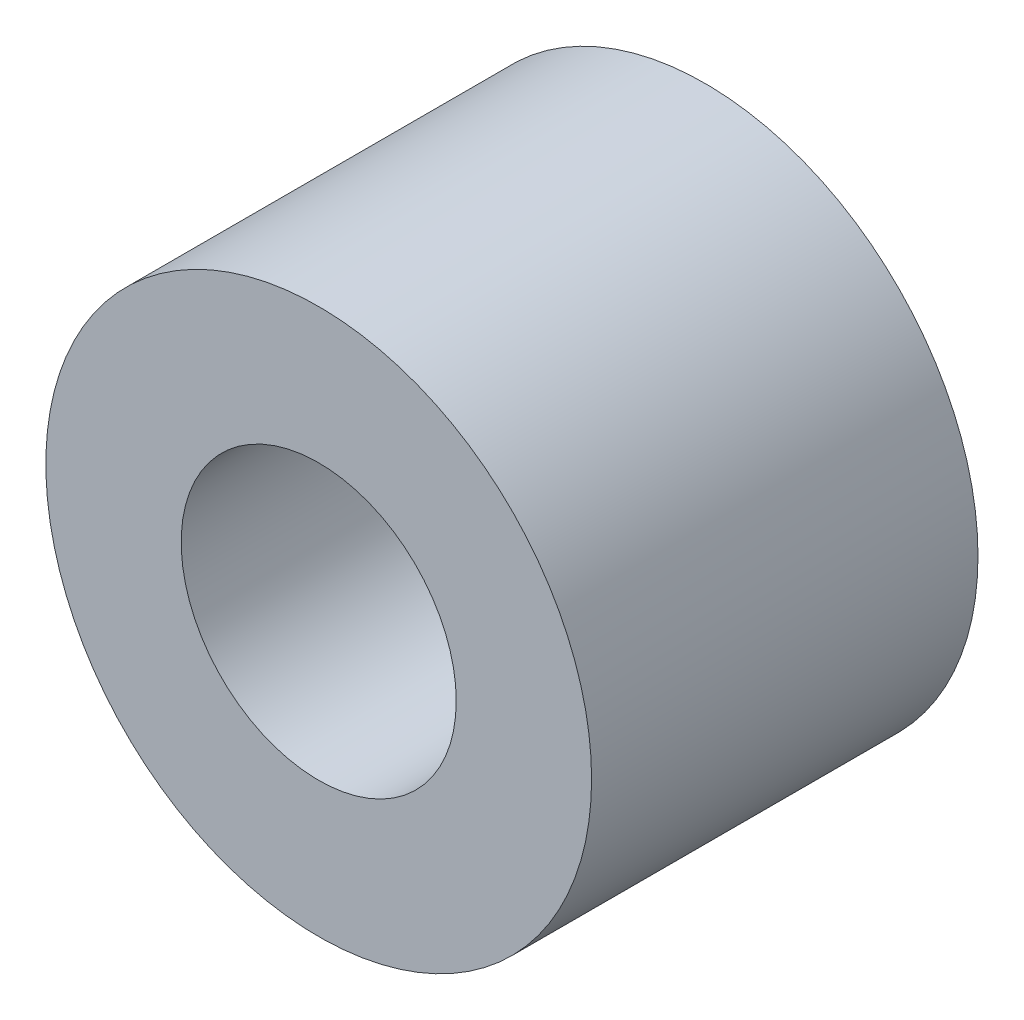
ISO-10303-21;
HEADER;
FILE_DESCRIPTION(('STEP AP214'),'2;1');
FILE_NAME('part.step','',(''),(''),'','','');
FILE_SCHEMA(('AUTOMOTIVE_DESIGN { 1 0 10303 214 1 1 1 1 }'));
ENDSEC;
DATA;
#1=APPLICATION_CONTEXT('core data for automotive mechanical design processes');
#2=APPLICATION_PROTOCOL_DEFINITION('international standard','automotive_design',2000,#1);
#3=PRODUCT_CONTEXT('',#1,'mechanical');
#4=PRODUCT('Part','Part','',(#3));
#5=PRODUCT_RELATED_PRODUCT_CATEGORY('part','',(#4));
#6=PRODUCT_DEFINITION_FORMATION('','',#4);
#7=PRODUCT_DEFINITION_CONTEXT('part definition',#1,'design');
#8=PRODUCT_DEFINITION('design','',#6,#7);
#9=PRODUCT_DEFINITION_SHAPE('','',#8);
#10=(LENGTH_UNIT() NAMED_UNIT(*) SI_UNIT(.MILLI.,.METRE.));
#11=(NAMED_UNIT(*) PLANE_ANGLE_UNIT() SI_UNIT($,.RADIAN.));
#12=(NAMED_UNIT(*) SI_UNIT($,.STERADIAN.) SOLID_ANGLE_UNIT());
#13=UNCERTAINTY_MEASURE_WITH_UNIT(LENGTH_MEASURE(1.E-05),#10,'distance_accuracy_value','');
#14=(GEOMETRIC_REPRESENTATION_CONTEXT(3) GLOBAL_UNCERTAINTY_ASSIGNED_CONTEXT((#13)) GLOBAL_UNIT_ASSIGNED_CONTEXT((#10,
#11,#12)) REPRESENTATION_CONTEXT('',''));
#15=CARTESIAN_POINT('',(0.,0.,0.));
#16=DIRECTION('',(0.,0.,1.));
#17=DIRECTION('',(1.,0.,0.));
#18=AXIS2_PLACEMENT_3D('',#15,#16,#17);
#19=CARTESIAN_POINT('',(0.,0.,8.9916));
#20=DIRECTION('',(0.,0.,1.));
#21=DIRECTION('',(1.,0.,0.));
#22=AXIS2_PLACEMENT_3D('',#19,#20,#21);
#23=PLANE('',#22);
#24=CARTESIAN_POINT('',(0.,0.,8.9916));
#25=DIRECTION('',(0.,0.,1.));
#26=DIRECTION('',(1.,0.,0.));
#27=AXIS2_PLACEMENT_3D('',#24,#25,#26);
#28=CIRCLE('',#27,6.35);
#29=CARTESIAN_POINT('',(6.35,0.,8.9916));
#30=VERTEX_POINT('',#29);
#31=EDGE_CURVE('E10',#30,#30,#28,.T.);
#32=ORIENTED_EDGE('',*,*,#31,.T.);
#33=EDGE_LOOP('',(#32));
#34=FACE_BOUND('',#33,.T.);
#35=CARTESIAN_POINT('',(0.,0.,8.9916));
#36=DIRECTION('',(0.,0.,1.));
#37=DIRECTION('',(1.,0.,0.));
#38=AXIS2_PLACEMENT_3D('',#35,#36,#37);
#39=CIRCLE('',#38,3.2004);
#40=CARTESIAN_POINT('',(3.2004,0.,8.9916));
#41=VERTEX_POINT('',#40);
#42=EDGE_CURVE('E48',#41,#41,#39,.T.);
#43=ORIENTED_EDGE('',*,*,#42,.F.);
#44=EDGE_LOOP('',(#43));
#45=FACE_BOUND('',#44,.T.);
#46=ADVANCED_FACE('F37',(#34,#45),#23,.T.);
#47=CARTESIAN_POINT('',(0.,0.,0.));
#48=DIRECTION('',(0.,0.,1.));
#49=DIRECTION('',(1.,0.,0.));
#50=AXIS2_PLACEMENT_3D('',#47,#48,#49);
#51=PLANE('',#50);
#52=CARTESIAN_POINT('',(0.,0.,0.));
#53=DIRECTION('',(0.,0.,1.));
#54=DIRECTION('',(1.,0.,0.));
#55=AXIS2_PLACEMENT_3D('',#52,#53,#54);
#56=CIRCLE('',#55,6.35);
#57=CARTESIAN_POINT('',(6.35,0.,0.));
#58=VERTEX_POINT('',#57);
#59=EDGE_CURVE('E41',#58,#58,#56,.T.);
#60=ORIENTED_EDGE('',*,*,#59,.F.);
#61=EDGE_LOOP('',(#60));
#62=FACE_BOUND('',#61,.T.);
#63=CARTESIAN_POINT('',(0.,0.,0.));
#64=DIRECTION('',(0.,0.,1.));
#65=DIRECTION('',(1.,0.,0.));
#66=AXIS2_PLACEMENT_3D('',#63,#64,#65);
#67=CIRCLE('',#66,3.2004);
#68=CARTESIAN_POINT('',(3.2004,0.,0.));
#69=VERTEX_POINT('',#68);
#70=EDGE_CURVE('E50',#69,#69,#67,.T.);
#71=ORIENTED_EDGE('',*,*,#70,.T.);
#72=EDGE_LOOP('',(#71));
#73=FACE_BOUND('',#72,.T.);
#74=ADVANCED_FACE('F60',(#62,#73),#51,.F.);
#75=CARTESIAN_POINT('',(0.,0.,8.9916));
#76=DIRECTION('',(0.,0.,-1.));
#77=DIRECTION('',(-1.,0.,0.));
#78=AXIS2_PLACEMENT_3D('',#75,#76,#77);
#79=CYLINDRICAL_SURFACE('',#78,6.35);
#80=ORIENTED_EDGE('',*,*,#31,.F.);
#81=EDGE_LOOP('',(#80));
#82=FACE_BOUND('',#81,.T.);
#83=ORIENTED_EDGE('',*,*,#59,.T.);
#84=EDGE_LOOP('',(#83));
#85=FACE_BOUND('',#84,.T.);
#86=ADVANCED_FACE('F39',(#82,#85),#79,.T.);
#87=CARTESIAN_POINT('',(0.,0.,8.9916));
#88=DIRECTION('',(0.,0.,-1.));
#89=DIRECTION('',(-1.,0.,0.));
#90=AXIS2_PLACEMENT_3D('',#87,#88,#89);
#91=CYLINDRICAL_SURFACE('',#90,3.2004);
#92=ORIENTED_EDGE('',*,*,#42,.T.);
#93=EDGE_LOOP('',(#92));
#94=FACE_BOUND('',#93,.T.);
#95=ORIENTED_EDGE('',*,*,#70,.F.);
#96=EDGE_LOOP('',(#95));
#97=FACE_BOUND('',#96,.T.);
#98=ADVANCED_FACE('F56',(#94,#97),#91,.F.);
#99=CLOSED_SHELL('',(#46,#74,#86,#98));
#100=MANIFOLD_SOLID_BREP('B2',#99);
#101=ADVANCED_BREP_SHAPE_REPRESENTATION('',(#18,#100),#14);
#102=SHAPE_DEFINITION_REPRESENTATION(#9,#101);
ENDSEC;
END-ISO-10303-21;
